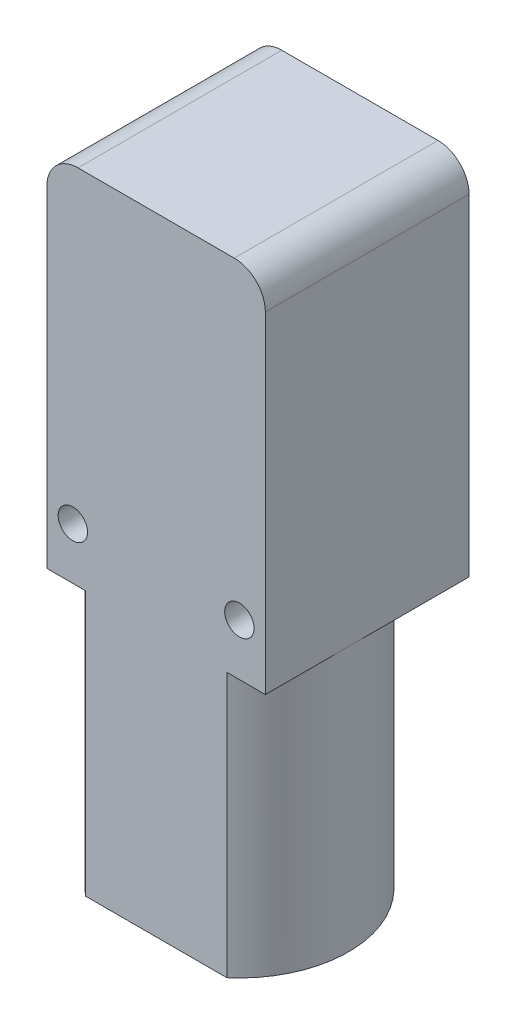
ISO-10303-21;
HEADER;
FILE_DESCRIPTION(('STEP AP214'),'2;1');
FILE_NAME('part.step','',(''),(''),'','','');
FILE_SCHEMA(('AUTOMOTIVE_DESIGN { 1 0 10303 214 1 1 1 1 }'));
ENDSEC;
DATA;
#1=APPLICATION_CONTEXT('core data for automotive mechanical design processes');
#2=APPLICATION_PROTOCOL_DEFINITION('international standard','automotive_design',2000,#1);
#3=PRODUCT_CONTEXT('',#1,'mechanical');
#4=PRODUCT('Part','Part','',(#3));
#5=PRODUCT_RELATED_PRODUCT_CATEGORY('part','',(#4));
#6=PRODUCT_DEFINITION_FORMATION('','',#4);
#7=PRODUCT_DEFINITION_CONTEXT('part definition',#1,'design');
#8=PRODUCT_DEFINITION('design','',#6,#7);
#9=PRODUCT_DEFINITION_SHAPE('','',#8);
#10=(LENGTH_UNIT() NAMED_UNIT(*) SI_UNIT(.MILLI.,.METRE.));
#11=(NAMED_UNIT(*) PLANE_ANGLE_UNIT() SI_UNIT($,.RADIAN.));
#12=(NAMED_UNIT(*) SI_UNIT($,.STERADIAN.) SOLID_ANGLE_UNIT());
#13=UNCERTAINTY_MEASURE_WITH_UNIT(LENGTH_MEASURE(1.E-05),#10,'distance_accuracy_value','');
#14=(GEOMETRIC_REPRESENTATION_CONTEXT(3) GLOBAL_UNCERTAINTY_ASSIGNED_CONTEXT((#13)) GLOBAL_UNIT_ASSIGNED_CONTEXT((#10,
#11,#12)) REPRESENTATION_CONTEXT('',''));
#15=CARTESIAN_POINT('',(0.,0.,0.));
#16=DIRECTION('',(0.,0.,1.));
#17=DIRECTION('',(1.,0.,0.));
#18=AXIS2_PLACEMENT_3D('',#15,#16,#17);
#19=CARTESIAN_POINT('',(0.,0.,5.));
#20=DIRECTION('',(0.,0.,1.));
#21=DIRECTION('',(1.,0.,0.));
#22=AXIS2_PLACEMENT_3D('',#19,#20,#21);
#23=PLANE('',#22);
#24=CARTESIAN_POINT('',(0.,0.,5.));
#25=DIRECTION('',(0.,0.,-1.));
#26=DIRECTION('',(-1.,0.,0.));
#27=AXIS2_PLACEMENT_3D('',#24,#25,#26);
#28=CIRCLE('',#27,3.5);
#29=CARTESIAN_POINT('',(-2.5475478405714,-2.4,5.));
#30=VERTEX_POINT('',#29);
#31=CARTESIAN_POINT('',(-2.5475478405714,2.4,5.));
#32=VERTEX_POINT('',#31);
#33=EDGE_CURVE('E201',#30,#32,#28,.T.);
#34=ORIENTED_EDGE('',*,*,#33,.F.);
#35=DIRECTION('',(-1.,0.,0.));
#36=VECTOR('',#35,1.);
#37=CARTESIAN_POINT('',(-2.5475478405714,-2.4,5.));
#38=LINE('',#37,#36);
#39=CARTESIAN_POINT('',(2.5475478405714,-2.4,5.));
#40=VERTEX_POINT('',#39);
#41=EDGE_CURVE('E194',#40,#30,#38,.T.);
#42=ORIENTED_EDGE('',*,*,#41,.F.);
#43=CARTESIAN_POINT('',(0.,0.,5.));
#44=DIRECTION('',(0.,0.,-1.));
#45=DIRECTION('',(-1.,0.,0.));
#46=AXIS2_PLACEMENT_3D('',#43,#44,#45);
#47=CIRCLE('',#46,3.5);
#48=CARTESIAN_POINT('',(2.5475478405714,2.4,5.));
#49=VERTEX_POINT('',#48);
#50=EDGE_CURVE('E207',#49,#40,#47,.T.);
#51=ORIENTED_EDGE('',*,*,#50,.F.);
#52=DIRECTION('',(1.,0.,0.));
#53=VECTOR('',#52,1.);
#54=CARTESIAN_POINT('',(-2.5475478405714,2.4,5.));
#55=LINE('',#54,#53);
#56=EDGE_CURVE('E204',#32,#49,#55,.T.);
#57=ORIENTED_EDGE('',*,*,#56,.F.);
#58=EDGE_LOOP('',(#34,#42,#51,#57));
#59=FACE_BOUND('',#58,.T.);
#60=CARTESIAN_POINT('',(8.5,-20.23,5.));
#61=DIRECTION('',(0.,0.,-1.));
#62=DIRECTION('',(-1.,0.,0.));
#63=AXIS2_PLACEMENT_3D('',#60,#61,#62);
#64=CIRCLE('',#63,1.5);
#65=CARTESIAN_POINT('',(7.,-20.23,5.));
#66=VERTEX_POINT('',#65);
#67=EDGE_CURVE('E224',#66,#66,#64,.T.);
#68=ORIENTED_EDGE('',*,*,#67,.F.);
#69=EDGE_LOOP('',(#68));
#70=FACE_BOUND('',#69,.T.);
#71=CARTESIAN_POINT('',(-8.5,-20.23,5.));
#72=DIRECTION('',(0.,0.,-1.));
#73=DIRECTION('',(-1.,0.,0.));
#74=AXIS2_PLACEMENT_3D('',#71,#72,#73);
#75=CIRCLE('',#74,1.5);
#76=CARTESIAN_POINT('',(-10.,-20.23,5.));
#77=VERTEX_POINT('',#76);
#78=EDGE_CURVE('E230',#77,#77,#75,.T.);
#79=ORIENTED_EDGE('',*,*,#78,.F.);
#80=EDGE_LOOP('',(#79));
#81=FACE_BOUND('',#80,.T.);
#82=DIRECTION('',(1.,0.,0.));
#83=VECTOR('',#82,1.);
#84=CARTESIAN_POINT('',(0.,-25.5,5.));
#85=LINE('',#84,#83);
#86=CARTESIAN_POINT('',(-11.15,-25.5,5.));
#87=VERTEX_POINT('',#86);
#88=CARTESIAN_POINT('',(11.15,-25.5,5.));
#89=VERTEX_POINT('',#88);
#90=EDGE_CURVE('E185',#87,#89,#85,.T.);
#91=ORIENTED_EDGE('',*,*,#90,.F.);
#92=DIRECTION('',(0.,-1.,0.));
#93=VECTOR('',#92,1.);
#94=CARTESIAN_POINT('',(-11.15,11.5,5.));
#95=LINE('',#94,#93);
#96=CARTESIAN_POINT('',(-11.15,8.325,5.));
#97=VERTEX_POINT('',#96);
#98=EDGE_CURVE('E233',#97,#87,#95,.T.);
#99=ORIENTED_EDGE('',*,*,#98,.F.);
#100=CARTESIAN_POINT('',(-7.975,8.325,5.));
#101=DIRECTION('',(0.,0.,1.));
#102=DIRECTION('',(1.,0.,0.));
#103=AXIS2_PLACEMENT_3D('',#100,#101,#102);
#104=CIRCLE('',#103,3.175);
#105=CARTESIAN_POINT('',(-7.975,11.5,5.));
#106=VERTEX_POINT('',#105);
#107=EDGE_CURVE('E257',#97,#106,#104,.F.);
#108=ORIENTED_EDGE('',*,*,#107,.T.);
#109=DIRECTION('',(-1.,0.,0.));
#110=VECTOR('',#109,1.);
#111=CARTESIAN_POINT('',(-11.15,11.5,5.));
#112=LINE('',#111,#110);
#113=CARTESIAN_POINT('',(7.97499999999999,11.5,5.));
#114=VERTEX_POINT('',#113);
#115=EDGE_CURVE('E239',#114,#106,#112,.T.);
#116=ORIENTED_EDGE('',*,*,#115,.F.);
#117=CARTESIAN_POINT('',(7.97499999999999,8.325,5.));
#118=DIRECTION('',(0.,0.,1.));
#119=DIRECTION('',(1.,0.,0.));
#120=AXIS2_PLACEMENT_3D('',#117,#118,#119);
#121=CIRCLE('',#120,3.175);
#122=CARTESIAN_POINT('',(11.15,8.325,5.));
#123=VERTEX_POINT('',#122);
#124=EDGE_CURVE('E259',#114,#123,#121,.F.);
#125=ORIENTED_EDGE('',*,*,#124,.T.);
#126=DIRECTION('',(0.,1.,0.));
#127=VECTOR('',#126,1.);
#128=CARTESIAN_POINT('',(11.15,11.5,5.));
#129=LINE('',#128,#127);
#130=EDGE_CURVE('E249',#89,#123,#129,.T.);
#131=ORIENTED_EDGE('',*,*,#130,.F.);
#132=EDGE_LOOP('',(#91,#99,#108,#116,#125,#131));
#133=FACE_BOUND('',#132,.T.);
#134=ADVANCED_FACE('F34',(#59,#70,#81,#133),#23,.F.);
#135=CARTESIAN_POINT('',(-11.15,11.5,25.8));
#136=DIRECTION('',(1.,0.,0.));
#137=DIRECTION('',(0.,1.,0.));
#138=AXIS2_PLACEMENT_3D('',#135,#136,#137);
#139=PLANE('',#138);
#140=DIRECTION('',(0.,0.,-1.));
#141=VECTOR('',#140,1.);
#142=CARTESIAN_POINT('',(-11.15,-25.5,25.8));
#143=LINE('',#142,#141);
#144=CARTESIAN_POINT('',(-11.15,-25.5,25.8));
#145=VERTEX_POINT('',#144);
#146=CARTESIAN_POINT('',(-11.15,-25.5,17.3));
#147=VERTEX_POINT('',#146);
#148=EDGE_CURVE('E189',#145,#147,#143,.T.);
#149=ORIENTED_EDGE('',*,*,#148,.F.);
#150=DIRECTION('',(0.,-1.,0.));
#151=VECTOR('',#150,1.);
#152=CARTESIAN_POINT('',(-11.15,11.5,25.8));
#153=LINE('',#152,#151);
#154=CARTESIAN_POINT('',(-11.15,8.325,25.8));
#155=VERTEX_POINT('',#154);
#156=EDGE_CURVE('E236',#155,#145,#153,.T.);
#157=ORIENTED_EDGE('',*,*,#156,.F.);
#158=DIRECTION('',(0.,0.,-1.));
#159=VECTOR('',#158,1.);
#160=CARTESIAN_POINT('',(-11.15,8.325,25.8));
#161=LINE('',#160,#159);
#162=EDGE_CURVE('E267',#155,#97,#161,.T.);
#163=ORIENTED_EDGE('',*,*,#162,.T.);
#164=ORIENTED_EDGE('',*,*,#98,.T.);
#165=EDGE_CURVE('E187',#147,#87,#143,.T.);
#166=ORIENTED_EDGE('',*,*,#165,.F.);
#167=EDGE_LOOP('',(#149,#157,#163,#164,#166));
#168=FACE_BOUND('',#167,.T.);
#169=ADVANCED_FACE('F297',(#168),#139,.F.);
#170=CARTESIAN_POINT('',(-11.15,-52.5,25.8));
#171=DIRECTION('',(0.,1.,0.));
#172=DIRECTION('',(0.,0.,1.));
#173=AXIS2_PLACEMENT_3D('',#170,#171,#172);
#174=PLANE('',#173);
#175=CARTESIAN_POINT('',(0.,-52.5,17.3));
#176=DIRECTION('',(0.,-1.,0.));
#177=DIRECTION('',(0.,0.,-1.));
#178=AXIS2_PLACEMENT_3D('',#175,#176,#177);
#179=CIRCLE('',#178,11.15);
#180=CARTESIAN_POINT('',(-7.21612777048745,-52.5,25.8));
#181=VERTEX_POINT('',#180);
#182=CARTESIAN_POINT('',(-7.21612777048744,-52.5,8.8));
#183=VERTEX_POINT('',#182);
#184=EDGE_CURVE('E172',#181,#183,#179,.T.);
#185=ORIENTED_EDGE('',*,*,#184,.T.);
#186=DIRECTION('',(1.,0.,0.));
#187=VECTOR('',#186,1.);
#188=CARTESIAN_POINT('',(-7.21612777048744,-52.5,8.8));
#189=LINE('',#188,#187);
#190=CARTESIAN_POINT('',(7.21612777048744,-52.5,8.79999999999999));
#191=VERTEX_POINT('',#190);
#192=EDGE_CURVE('E163',#183,#191,#189,.T.);
#193=ORIENTED_EDGE('',*,*,#192,.T.);
#194=CARTESIAN_POINT('',(0.,-52.5,17.3));
#195=DIRECTION('',(0.,-1.,0.));
#196=DIRECTION('',(0.,0.,-1.));
#197=AXIS2_PLACEMENT_3D('',#194,#195,#196);
#198=CIRCLE('',#197,11.15);
#199=CARTESIAN_POINT('',(7.21612777048745,-52.5,25.8));
#200=VERTEX_POINT('',#199);
#201=EDGE_CURVE('E156',#191,#200,#198,.T.);
#202=ORIENTED_EDGE('',*,*,#201,.T.);
#203=DIRECTION('',(1.,0.,0.));
#204=VECTOR('',#203,1.);
#205=CARTESIAN_POINT('',(-11.15,-52.5,25.8));
#206=LINE('',#205,#204);
#207=EDGE_CURVE('E238',#181,#200,#206,.T.);
#208=ORIENTED_EDGE('',*,*,#207,.F.);
#209=EDGE_LOOP('',(#185,#193,#202,#208));
#210=FACE_BOUND('',#209,.T.);
#211=ADVANCED_FACE('F303',(#210),#174,.F.);
#212=CARTESIAN_POINT('',(11.15,11.5,25.8));
#213=DIRECTION('',(-1.,0.,0.));
#214=DIRECTION('',(0.,-1.,0.));
#215=AXIS2_PLACEMENT_3D('',#212,#213,#214);
#216=PLANE('',#215);
#217=DIRECTION('',(0.,0.,1.));
#218=VECTOR('',#217,1.);
#219=CARTESIAN_POINT('',(11.15,-25.5,25.8));
#220=LINE('',#219,#218);
#221=CARTESIAN_POINT('',(11.15,-25.5,17.3));
#222=VERTEX_POINT('',#221);
#223=EDGE_CURVE('E184',#89,#222,#220,.T.);
#224=ORIENTED_EDGE('',*,*,#223,.F.);
#225=ORIENTED_EDGE('',*,*,#130,.T.);
#226=DIRECTION('',(0.,0.,-1.));
#227=VECTOR('',#226,1.);
#228=CARTESIAN_POINT('',(11.15,8.325,25.8));
#229=LINE('',#228,#227);
#230=CARTESIAN_POINT('',(11.15,8.325,25.8));
#231=VERTEX_POINT('',#230);
#232=EDGE_CURVE('E262',#123,#231,#229,.F.);
#233=ORIENTED_EDGE('',*,*,#232,.T.);
#234=DIRECTION('',(0.,1.,0.));
#235=VECTOR('',#234,1.);
#236=CARTESIAN_POINT('',(11.15,11.5,25.8));
#237=LINE('',#236,#235);
#238=CARTESIAN_POINT('',(11.15,-25.5,25.8));
#239=VERTEX_POINT('',#238);
#240=EDGE_CURVE('E242',#239,#231,#237,.T.);
#241=ORIENTED_EDGE('',*,*,#240,.F.);
#242=EDGE_CURVE('E179',#222,#239,#220,.T.);
#243=ORIENTED_EDGE('',*,*,#242,.F.);
#244=EDGE_LOOP('',(#224,#225,#233,#241,#243));
#245=FACE_BOUND('',#244,.T.);
#246=ADVANCED_FACE('F281',(#245),#216,.F.);
#247=CARTESIAN_POINT('',(0.,0.,25.8));
#248=DIRECTION('',(0.,0.,1.));
#249=DIRECTION('',(1.,0.,0.));
#250=AXIS2_PLACEMENT_3D('',#247,#248,#249);
#251=PLANE('',#250);
#252=DIRECTION('',(0.,-1.,0.));
#253=VECTOR('',#252,1.);
#254=CARTESIAN_POINT('',(7.21612777048745,-25.5,25.8));
#255=LINE('',#254,#253);
#256=CARTESIAN_POINT('',(7.21612777048745,-25.5,25.8));
#257=VERTEX_POINT('',#256);
#258=EDGE_CURVE('E180',#257,#200,#255,.T.);
#259=ORIENTED_EDGE('',*,*,#258,.F.);
#260=DIRECTION('',(1.,0.,0.));
#261=VECTOR('',#260,1.);
#262=CARTESIAN_POINT('',(0.,-25.5,25.8));
#263=LINE('',#262,#261);
#264=EDGE_CURVE('E38',#257,#239,#263,.T.);
#265=ORIENTED_EDGE('',*,*,#264,.T.);
#266=ORIENTED_EDGE('',*,*,#240,.T.);
#267=CARTESIAN_POINT('',(7.97499999999999,8.325,25.8));
#268=DIRECTION('',(0.,0.,1.));
#269=DIRECTION('',(1.,0.,0.));
#270=AXIS2_PLACEMENT_3D('',#267,#268,#269);
#271=CIRCLE('',#270,3.175);
#272=CARTESIAN_POINT('',(7.97499999999999,11.5,25.8));
#273=VERTEX_POINT('',#272);
#274=EDGE_CURVE('E266',#231,#273,#271,.T.);
#275=ORIENTED_EDGE('',*,*,#274,.T.);
#276=DIRECTION('',(-1.,0.,0.));
#277=VECTOR('',#276,1.);
#278=CARTESIAN_POINT('',(-11.15,11.5,25.8));
#279=LINE('',#278,#277);
#280=CARTESIAN_POINT('',(-7.975,11.5,25.8));
#281=VERTEX_POINT('',#280);
#282=EDGE_CURVE('E244',#273,#281,#279,.T.);
#283=ORIENTED_EDGE('',*,*,#282,.T.);
#284=CARTESIAN_POINT('',(-7.975,8.325,25.8));
#285=DIRECTION('',(0.,0.,1.));
#286=DIRECTION('',(1.,0.,0.));
#287=AXIS2_PLACEMENT_3D('',#284,#285,#286);
#288=CIRCLE('',#287,3.175);
#289=EDGE_CURVE('E57',#281,#155,#288,.T.);
#290=ORIENTED_EDGE('',*,*,#289,.T.);
#291=ORIENTED_EDGE('',*,*,#156,.T.);
#292=CARTESIAN_POINT('',(-7.21612777048745,-25.5,25.8));
#293=VERTEX_POINT('',#292);
#294=EDGE_CURVE('E12',#145,#293,#263,.T.);
#295=ORIENTED_EDGE('',*,*,#294,.T.);
#296=DIRECTION('',(0.,-1.,0.));
#297=VECTOR('',#296,1.);
#298=CARTESIAN_POINT('',(-7.21612777048745,-25.5,25.8));
#299=LINE('',#298,#297);
#300=EDGE_CURVE('E176',#293,#181,#299,.T.);
#301=ORIENTED_EDGE('',*,*,#300,.T.);
#302=ORIENTED_EDGE('',*,*,#207,.T.);
#303=EDGE_LOOP('',(#259,#265,#266,#275,#283,#290,#291,#295,#301,#302));
#304=FACE_BOUND('',#303,.T.);
#305=CARTESIAN_POINT('',(8.5,-20.23,25.8));
#306=DIRECTION('',(0.,0.,1.));
#307=DIRECTION('',(1.,0.,0.));
#308=AXIS2_PLACEMENT_3D('',#305,#306,#307);
#309=CIRCLE('',#308,1.5);
#310=CARTESIAN_POINT('',(7.,-20.23,25.8));
#311=VERTEX_POINT('',#310);
#312=EDGE_CURVE('E223',#311,#311,#309,.F.);
#313=ORIENTED_EDGE('',*,*,#312,.T.);
#314=EDGE_LOOP('',(#313));
#315=FACE_BOUND('',#314,.T.);
#316=CARTESIAN_POINT('',(-8.5,-20.23,25.8));
#317=DIRECTION('',(0.,0.,1.));
#318=DIRECTION('',(1.,0.,0.));
#319=AXIS2_PLACEMENT_3D('',#316,#317,#318);
#320=CIRCLE('',#319,1.5);
#321=CARTESIAN_POINT('',(-10.,-20.23,25.8));
#322=VERTEX_POINT('',#321);
#323=EDGE_CURVE('E227',#322,#322,#320,.F.);
#324=ORIENTED_EDGE('',*,*,#323,.T.);
#325=EDGE_LOOP('',(#324));
#326=FACE_BOUND('',#325,.T.);
#327=ADVANCED_FACE('F275',(#304,#315,#326),#251,.T.);
#328=CARTESIAN_POINT('',(-11.15,11.5,25.8));
#329=DIRECTION('',(0.,-1.,0.));
#330=DIRECTION('',(0.,0.,-1.));
#331=AXIS2_PLACEMENT_3D('',#328,#329,#330);
#332=PLANE('',#331);
#333=ORIENTED_EDGE('',*,*,#282,.F.);
#334=DIRECTION('',(0.,0.,-1.));
#335=VECTOR('',#334,1.);
#336=CARTESIAN_POINT('',(7.97499999999999,11.5,25.8));
#337=LINE('',#336,#335);
#338=EDGE_CURVE('E254',#273,#114,#337,.T.);
#339=ORIENTED_EDGE('',*,*,#338,.T.);
#340=ORIENTED_EDGE('',*,*,#115,.T.);
#341=DIRECTION('',(0.,0.,-1.));
#342=VECTOR('',#341,1.);
#343=CARTESIAN_POINT('',(-7.975,11.5,25.8));
#344=LINE('',#343,#342);
#345=EDGE_CURVE('E246',#106,#281,#344,.F.);
#346=ORIENTED_EDGE('',*,*,#345,.T.);
#347=EDGE_LOOP('',(#333,#339,#340,#346));
#348=FACE_BOUND('',#347,.T.);
#349=ADVANCED_FACE('F290',(#348),#332,.F.);
#350=CARTESIAN_POINT('',(-8.5,-20.23,25.801));
#351=DIRECTION('',(0.,0.,-1.));
#352=DIRECTION('',(-1.,0.,0.));
#353=AXIS2_PLACEMENT_3D('',#350,#351,#352);
#354=CYLINDRICAL_SURFACE('',#353,1.5);
#355=CARTESIAN_POINT('',(-10.,-20.23,25.8));
#356=CARTESIAN_POINT('',(-10.,-20.23,25.5833333333333));
#357=CARTESIAN_POINT('',(-10.,-20.23,25.3666666666667));
#358=CARTESIAN_POINT('',(-10.,-20.23,24.9333333333333));
#359=CARTESIAN_POINT('',(-10.,-20.23,24.7166666666667));
#360=CARTESIAN_POINT('',(-10.,-20.23,24.2833333333333));
#361=CARTESIAN_POINT('',(-10.,-20.23,24.0666666666667));
#362=CARTESIAN_POINT('',(-10.,-20.23,23.6333333333333));
#363=CARTESIAN_POINT('',(-10.,-20.23,23.4166666666667));
#364=CARTESIAN_POINT('',(-10.,-20.23,22.9833333333333));
#365=CARTESIAN_POINT('',(-10.,-20.23,22.7666666666667));
#366=CARTESIAN_POINT('',(-10.,-20.23,22.3333333333333));
#367=CARTESIAN_POINT('',(-10.,-20.23,22.1166666666667));
#368=CARTESIAN_POINT('',(-10.,-20.23,21.6833333333333));
#369=CARTESIAN_POINT('',(-10.,-20.23,21.4666666666667));
#370=CARTESIAN_POINT('',(-10.,-20.23,21.0333333333333));
#371=CARTESIAN_POINT('',(-10.,-20.23,20.8166666666667));
#372=CARTESIAN_POINT('',(-10.,-20.23,20.3833333333333));
#373=CARTESIAN_POINT('',(-10.,-20.23,20.1666666666667));
#374=CARTESIAN_POINT('',(-10.,-20.23,19.7333333333333));
#375=CARTESIAN_POINT('',(-10.,-20.23,19.5166666666667));
#376=CARTESIAN_POINT('',(-10.,-20.23,19.0833333333333));
#377=CARTESIAN_POINT('',(-10.,-20.23,18.8666666666667));
#378=CARTESIAN_POINT('',(-10.,-20.23,18.4333333333333));
#379=CARTESIAN_POINT('',(-10.,-20.23,18.2166666666667));
#380=CARTESIAN_POINT('',(-10.,-20.23,17.7833333333333));
#381=CARTESIAN_POINT('',(-10.,-20.23,17.5666666666667));
#382=CARTESIAN_POINT('',(-10.,-20.23,17.1333333333333));
#383=CARTESIAN_POINT('',(-10.,-20.23,16.9166666666667));
#384=CARTESIAN_POINT('',(-10.,-20.23,16.4833333333333));
#385=CARTESIAN_POINT('',(-10.,-20.23,16.2666666666667));
#386=CARTESIAN_POINT('',(-10.,-20.23,15.8333333333333));
#387=CARTESIAN_POINT('',(-10.,-20.23,15.6166666666667));
#388=CARTESIAN_POINT('',(-10.,-20.23,15.1833333333333));
#389=CARTESIAN_POINT('',(-10.,-20.23,14.9666666666667));
#390=CARTESIAN_POINT('',(-10.,-20.23,14.5333333333333));
#391=CARTESIAN_POINT('',(-10.,-20.23,14.3166666666667));
#392=CARTESIAN_POINT('',(-10.,-20.23,13.8833333333333));
#393=CARTESIAN_POINT('',(-10.,-20.23,13.6666666666667));
#394=CARTESIAN_POINT('',(-10.,-20.23,13.2333333333333));
#395=CARTESIAN_POINT('',(-10.,-20.23,13.0166666666667));
#396=CARTESIAN_POINT('',(-10.,-20.23,12.5833333333333));
#397=CARTESIAN_POINT('',(-10.,-20.23,12.3666666666667));
#398=CARTESIAN_POINT('',(-10.,-20.23,11.9333333333333));
#399=CARTESIAN_POINT('',(-10.,-20.23,11.7166666666667));
#400=CARTESIAN_POINT('',(-10.,-20.23,11.2833333333333));
#401=CARTESIAN_POINT('',(-10.,-20.23,11.0666666666667));
#402=CARTESIAN_POINT('',(-10.,-20.23,10.6333333333333));
#403=CARTESIAN_POINT('',(-10.,-20.23,10.4166666666667));
#404=CARTESIAN_POINT('',(-10.,-20.23,9.98333333333333));
#405=CARTESIAN_POINT('',(-10.,-20.23,9.76666666666666));
#406=CARTESIAN_POINT('',(-10.,-20.23,9.33333333333333));
#407=CARTESIAN_POINT('',(-10.,-20.23,9.11666666666666));
#408=CARTESIAN_POINT('',(-10.,-20.23,8.68333333333333));
#409=CARTESIAN_POINT('',(-10.,-20.23,8.46666666666666));
#410=CARTESIAN_POINT('',(-10.,-20.23,8.03333333333333));
#411=CARTESIAN_POINT('',(-10.,-20.23,7.81666666666666));
#412=CARTESIAN_POINT('',(-10.,-20.23,7.38333333333333));
#413=CARTESIAN_POINT('',(-10.,-20.23,7.16666666666666));
#414=CARTESIAN_POINT('',(-10.,-20.23,6.73333333333333));
#415=CARTESIAN_POINT('',(-10.,-20.23,6.51666666666666));
#416=CARTESIAN_POINT('',(-10.,-20.23,6.08333333333333));
#417=CARTESIAN_POINT('',(-10.,-20.23,5.86666666666666));
#418=CARTESIAN_POINT('',(-10.,-20.23,5.43333333333333));
#419=CARTESIAN_POINT('',(-10.,-20.23,5.21666666666666));
#420=CARTESIAN_POINT('',(-10.,-20.23,5.));
#421=B_SPLINE_CURVE_WITH_KNOTS('',3,(#355,#356,#357,#358,#359,#360,#361,#362,#363,#364,#365,
#366,#367,#368,#369,#370,#371,#372,#373,#374,#375,#376,#377,#378,#379,#380,#381,#382,#383,#384,
#385,#386,#387,#388,#389,#390,#391,#392,#393,#394,#395,#396,#397,#398,#399,#400,#401,#402,#403,
#404,#405,#406,#407,#408,#409,#410,#411,#412,#413,#414,#415,#416,#417,#418,#419,#420),
.UNSPECIFIED.,.F.,.F.,(4,2,2,2,2,2,2,2,2,2,2,2,2,2,2,2,2,2,2,2,2,2,2,2,2,2,2,2,2,2,2,2,4),(0.,
0.650000000000001,1.3,1.95,2.6,3.25,3.9,4.55,5.2,5.85,6.5,7.15,7.80000000000001,8.45,9.1,
9.75000000000001,10.4,11.05,11.7,12.35,13.,13.65,14.3,14.95,15.6,16.25,16.9,17.55,18.2,18.85,
19.5,20.15,20.8),.UNSPECIFIED.);
#422=EDGE_CURVE('BSEAM331',#322,#77,#421,.T.);
#423=ORIENTED_EDGE('',*,*,#323,.F.);
#424=ORIENTED_EDGE('',*,*,#78,.T.);
#425=ORIENTED_EDGE('',*,*,#422,.T.);
#426=ORIENTED_EDGE('',*,*,#422,.F.);
#427=EDGE_LOOP('',(#423,#425,#424,#426));
#428=FACE_BOUND('',#427,.T.);
#429=ADVANCED_FACE('F331',(#428),#354,.F.);
#430=CARTESIAN_POINT('',(8.5,-20.23,25.801));
#431=DIRECTION('',(0.,0.,-1.));
#432=DIRECTION('',(-1.,0.,0.));
#433=AXIS2_PLACEMENT_3D('',#430,#431,#432);
#434=CYLINDRICAL_SURFACE('',#433,1.5);
#435=CARTESIAN_POINT('',(7.,-20.23,25.8));
#436=CARTESIAN_POINT('',(7.,-20.23,25.5833333333333));
#437=CARTESIAN_POINT('',(7.,-20.23,25.3666666666667));
#438=CARTESIAN_POINT('',(7.,-20.23,24.9333333333333));
#439=CARTESIAN_POINT('',(7.,-20.23,24.7166666666667));
#440=CARTESIAN_POINT('',(7.,-20.23,24.2833333333333));
#441=CARTESIAN_POINT('',(7.,-20.23,24.0666666666667));
#442=CARTESIAN_POINT('',(7.,-20.23,23.6333333333333));
#443=CARTESIAN_POINT('',(7.,-20.23,23.4166666666667));
#444=CARTESIAN_POINT('',(7.,-20.23,22.9833333333333));
#445=CARTESIAN_POINT('',(7.,-20.23,22.7666666666667));
#446=CARTESIAN_POINT('',(7.,-20.23,22.3333333333333));
#447=CARTESIAN_POINT('',(7.,-20.23,22.1166666666667));
#448=CARTESIAN_POINT('',(7.,-20.23,21.6833333333333));
#449=CARTESIAN_POINT('',(7.,-20.23,21.4666666666667));
#450=CARTESIAN_POINT('',(7.,-20.23,21.0333333333333));
#451=CARTESIAN_POINT('',(7.,-20.23,20.8166666666667));
#452=CARTESIAN_POINT('',(7.,-20.23,20.3833333333333));
#453=CARTESIAN_POINT('',(7.,-20.23,20.1666666666667));
#454=CARTESIAN_POINT('',(7.,-20.23,19.7333333333333));
#455=CARTESIAN_POINT('',(7.,-20.23,19.5166666666667));
#456=CARTESIAN_POINT('',(7.,-20.23,19.0833333333333));
#457=CARTESIAN_POINT('',(7.,-20.23,18.8666666666667));
#458=CARTESIAN_POINT('',(7.,-20.23,18.4333333333333));
#459=CARTESIAN_POINT('',(7.,-20.23,18.2166666666667));
#460=CARTESIAN_POINT('',(7.,-20.23,17.7833333333333));
#461=CARTESIAN_POINT('',(7.,-20.23,17.5666666666667));
#462=CARTESIAN_POINT('',(7.,-20.23,17.1333333333333));
#463=CARTESIAN_POINT('',(7.,-20.23,16.9166666666667));
#464=CARTESIAN_POINT('',(7.,-20.23,16.4833333333333));
#465=CARTESIAN_POINT('',(7.,-20.23,16.2666666666667));
#466=CARTESIAN_POINT('',(7.,-20.23,15.8333333333333));
#467=CARTESIAN_POINT('',(7.,-20.23,15.6166666666667));
#468=CARTESIAN_POINT('',(7.,-20.23,15.1833333333333));
#469=CARTESIAN_POINT('',(7.,-20.23,14.9666666666667));
#470=CARTESIAN_POINT('',(7.,-20.23,14.5333333333333));
#471=CARTESIAN_POINT('',(7.,-20.23,14.3166666666667));
#472=CARTESIAN_POINT('',(7.,-20.23,13.8833333333333));
#473=CARTESIAN_POINT('',(7.,-20.23,13.6666666666667));
#474=CARTESIAN_POINT('',(7.,-20.23,13.2333333333333));
#475=CARTESIAN_POINT('',(7.,-20.23,13.0166666666667));
#476=CARTESIAN_POINT('',(7.,-20.23,12.5833333333333));
#477=CARTESIAN_POINT('',(7.,-20.23,12.3666666666667));
#478=CARTESIAN_POINT('',(7.,-20.23,11.9333333333333));
#479=CARTESIAN_POINT('',(7.,-20.23,11.7166666666667));
#480=CARTESIAN_POINT('',(7.,-20.23,11.2833333333333));
#481=CARTESIAN_POINT('',(7.,-20.23,11.0666666666667));
#482=CARTESIAN_POINT('',(7.,-20.23,10.6333333333333));
#483=CARTESIAN_POINT('',(7.,-20.23,10.4166666666667));
#484=CARTESIAN_POINT('',(7.,-20.23,9.98333333333333));
#485=CARTESIAN_POINT('',(7.,-20.23,9.76666666666666));
#486=CARTESIAN_POINT('',(7.,-20.23,9.33333333333333));
#487=CARTESIAN_POINT('',(7.,-20.23,9.11666666666666));
#488=CARTESIAN_POINT('',(7.,-20.23,8.68333333333333));
#489=CARTESIAN_POINT('',(7.,-20.23,8.46666666666666));
#490=CARTESIAN_POINT('',(7.,-20.23,8.03333333333333));
#491=CARTESIAN_POINT('',(7.,-20.23,7.81666666666666));
#492=CARTESIAN_POINT('',(7.,-20.23,7.38333333333333));
#493=CARTESIAN_POINT('',(7.,-20.23,7.16666666666666));
#494=CARTESIAN_POINT('',(7.,-20.23,6.73333333333333));
#495=CARTESIAN_POINT('',(7.,-20.23,6.51666666666666));
#496=CARTESIAN_POINT('',(7.,-20.23,6.08333333333333));
#497=CARTESIAN_POINT('',(7.,-20.23,5.86666666666666));
#498=CARTESIAN_POINT('',(7.,-20.23,5.43333333333333));
#499=CARTESIAN_POINT('',(7.,-20.23,5.21666666666666));
#500=CARTESIAN_POINT('',(7.,-20.23,5.));
#501=B_SPLINE_CURVE_WITH_KNOTS('',3,(#435,#436,#437,#438,#439,#440,#441,#442,#443,#444,#445,
#446,#447,#448,#449,#450,#451,#452,#453,#454,#455,#456,#457,#458,#459,#460,#461,#462,#463,#464,
#465,#466,#467,#468,#469,#470,#471,#472,#473,#474,#475,#476,#477,#478,#479,#480,#481,#482,#483,
#484,#485,#486,#487,#488,#489,#490,#491,#492,#493,#494,#495,#496,#497,#498,#499,#500),
.UNSPECIFIED.,.F.,.F.,(4,2,2,2,2,2,2,2,2,2,2,2,2,2,2,2,2,2,2,2,2,2,2,2,2,2,2,2,2,2,2,2,4),(0.,
0.650000000000001,1.3,1.95,2.6,3.25,3.9,4.55,5.2,5.85,6.5,7.15,7.80000000000001,8.45,9.1,
9.75000000000001,10.4,11.05,11.7,12.35,13.,13.65,14.3,14.95,15.6,16.25,16.9,17.55,18.2,18.85,
19.5,20.15,20.8),.UNSPECIFIED.);
#502=EDGE_CURVE('BSEAM360',#311,#66,#501,.T.);
#503=ORIENTED_EDGE('',*,*,#312,.F.);
#504=ORIENTED_EDGE('',*,*,#67,.T.);
#505=ORIENTED_EDGE('',*,*,#502,.T.);
#506=ORIENTED_EDGE('',*,*,#502,.F.);
#507=EDGE_LOOP('',(#503,#505,#504,#506));
#508=FACE_BOUND('',#507,.T.);
#509=ADVANCED_FACE('F360',(#508),#434,.F.);
#510=CARTESIAN_POINT('',(0.,0.,0.));
#511=DIRECTION('',(0.,0.,1.));
#512=DIRECTION('',(1.,0.,0.));
#513=AXIS2_PLACEMENT_3D('',#510,#511,#512);
#514=CYLINDRICAL_SURFACE('',#513,3.5);
#515=ORIENTED_EDGE('',*,*,#33,.T.);
#516=DIRECTION('',(0.,0.,1.));
#517=VECTOR('',#516,1.);
#518=CARTESIAN_POINT('',(-2.5475478405714,2.4,0.));
#519=LINE('',#518,#517);
#520=CARTESIAN_POINT('',(-2.5475478405714,2.4,0.));
#521=VERTEX_POINT('',#520);
#522=EDGE_CURVE('E220',#521,#32,#519,.T.);
#523=ORIENTED_EDGE('',*,*,#522,.F.);
#524=CARTESIAN_POINT('',(0.,0.,0.));
#525=DIRECTION('',(0.,0.,-1.));
#526=DIRECTION('',(-1.,0.,0.));
#527=AXIS2_PLACEMENT_3D('',#524,#525,#526);
#528=CIRCLE('',#527,3.5);
#529=CARTESIAN_POINT('',(-2.5475478405714,-2.4,0.));
#530=VERTEX_POINT('',#529);
#531=EDGE_CURVE('E190',#530,#521,#528,.T.);
#532=ORIENTED_EDGE('',*,*,#531,.F.);
#533=DIRECTION('',(0.,0.,1.));
#534=VECTOR('',#533,1.);
#535=CARTESIAN_POINT('',(-2.5475478405714,-2.4,0.));
#536=LINE('',#535,#534);
#537=EDGE_CURVE('E200',#530,#30,#536,.T.);
#538=ORIENTED_EDGE('',*,*,#537,.T.);
#539=EDGE_LOOP('',(#515,#523,#532,#538));
#540=FACE_BOUND('',#539,.T.);
#541=ADVANCED_FACE('F356',(#540),#514,.T.);
#542=CARTESIAN_POINT('',(-2.5475478405714,2.4,0.));
#543=DIRECTION('',(0.,-1.,0.));
#544=DIRECTION('',(0.,0.,-1.));
#545=AXIS2_PLACEMENT_3D('',#542,#543,#544);
#546=PLANE('',#545);
#547=ORIENTED_EDGE('',*,*,#56,.T.);
#548=DIRECTION('',(0.,0.,1.));
#549=VECTOR('',#548,1.);
#550=CARTESIAN_POINT('',(2.5475478405714,2.4,0.));
#551=LINE('',#550,#549);
#552=CARTESIAN_POINT('',(2.5475478405714,2.4,0.));
#553=VERTEX_POINT('',#552);
#554=EDGE_CURVE('E217',#553,#49,#551,.T.);
#555=ORIENTED_EDGE('',*,*,#554,.F.);
#556=DIRECTION('',(1.,0.,0.));
#557=VECTOR('',#556,1.);
#558=CARTESIAN_POINT('',(-2.5475478405714,2.4,0.));
#559=LINE('',#558,#557);
#560=EDGE_CURVE('E193',#521,#553,#559,.T.);
#561=ORIENTED_EDGE('',*,*,#560,.F.);
#562=ORIENTED_EDGE('',*,*,#522,.T.);
#563=EDGE_LOOP('',(#547,#555,#561,#562));
#564=FACE_BOUND('',#563,.T.);
#565=ADVANCED_FACE('F352',(#564),#546,.F.);
#566=CARTESIAN_POINT('',(0.,0.,0.));
#567=DIRECTION('',(0.,0.,1.));
#568=DIRECTION('',(1.,0.,0.));
#569=AXIS2_PLACEMENT_3D('',#566,#567,#568);
#570=CYLINDRICAL_SURFACE('',#569,3.5);
#571=ORIENTED_EDGE('',*,*,#50,.T.);
#572=DIRECTION('',(0.,0.,1.));
#573=VECTOR('',#572,1.);
#574=CARTESIAN_POINT('',(2.5475478405714,-2.4,0.));
#575=LINE('',#574,#573);
#576=CARTESIAN_POINT('',(2.5475478405714,-2.4,0.));
#577=VERTEX_POINT('',#576);
#578=EDGE_CURVE('E214',#577,#40,#575,.T.);
#579=ORIENTED_EDGE('',*,*,#578,.F.);
#580=CARTESIAN_POINT('',(0.,0.,0.));
#581=DIRECTION('',(0.,0.,-1.));
#582=DIRECTION('',(-1.,0.,0.));
#583=AXIS2_PLACEMENT_3D('',#580,#581,#582);
#584=CIRCLE('',#583,3.5);
#585=EDGE_CURVE('E196',#553,#577,#584,.T.);
#586=ORIENTED_EDGE('',*,*,#585,.F.);
#587=ORIENTED_EDGE('',*,*,#554,.T.);
#588=EDGE_LOOP('',(#571,#579,#586,#587));
#589=FACE_BOUND('',#588,.T.);
#590=ADVANCED_FACE('F346',(#589),#570,.T.);
#591=CARTESIAN_POINT('',(-2.5475478405714,-2.4,0.));
#592=DIRECTION('',(0.,1.,0.));
#593=DIRECTION('',(0.,0.,1.));
#594=AXIS2_PLACEMENT_3D('',#591,#592,#593);
#595=PLANE('',#594);
#596=ORIENTED_EDGE('',*,*,#41,.T.);
#597=ORIENTED_EDGE('',*,*,#537,.F.);
#598=DIRECTION('',(-1.,0.,0.));
#599=VECTOR('',#598,1.);
#600=CARTESIAN_POINT('',(-2.5475478405714,-2.4,0.));
#601=LINE('',#600,#599);
#602=EDGE_CURVE('E198',#577,#530,#601,.T.);
#603=ORIENTED_EDGE('',*,*,#602,.F.);
#604=ORIENTED_EDGE('',*,*,#578,.T.);
#605=EDGE_LOOP('',(#596,#597,#603,#604));
#606=FACE_BOUND('',#605,.T.);
#607=ADVANCED_FACE('F341',(#606),#595,.F.);
#608=CARTESIAN_POINT('',(0.,0.,0.));
#609=DIRECTION('',(0.,0.,-1.));
#610=DIRECTION('',(-1.,0.,0.));
#611=AXIS2_PLACEMENT_3D('',#608,#609,#610);
#612=PLANE('',#611);
#613=ORIENTED_EDGE('',*,*,#531,.T.);
#614=ORIENTED_EDGE('',*,*,#560,.T.);
#615=ORIENTED_EDGE('',*,*,#585,.T.);
#616=ORIENTED_EDGE('',*,*,#602,.T.);
#617=EDGE_LOOP('',(#613,#614,#615,#616));
#618=FACE_BOUND('',#617,.T.);
#619=ADVANCED_FACE('F336',(#618),#612,.T.);
#620=CARTESIAN_POINT('',(7.97499999999999,8.325,25.8));
#621=DIRECTION('',(0.,0.,-1.));
#622=DIRECTION('',(-1.,0.,0.));
#623=AXIS2_PLACEMENT_3D('',#620,#621,#622);
#624=CYLINDRICAL_SURFACE('',#623,3.175);
#625=ORIENTED_EDGE('',*,*,#274,.F.);
#626=ORIENTED_EDGE('',*,*,#232,.F.);
#627=ORIENTED_EDGE('',*,*,#124,.F.);
#628=ORIENTED_EDGE('',*,*,#338,.F.);
#629=EDGE_LOOP('',(#625,#626,#627,#628));
#630=FACE_BOUND('',#629,.T.);
#631=ADVANCED_FACE('F287',(#630),#624,.T.);
#632=CARTESIAN_POINT('',(-7.975,8.325,25.8));
#633=DIRECTION('',(0.,0.,-1.));
#634=DIRECTION('',(-1.,0.,0.));
#635=AXIS2_PLACEMENT_3D('',#632,#633,#634);
#636=CYLINDRICAL_SURFACE('',#635,3.175);
#637=ORIENTED_EDGE('',*,*,#289,.F.);
#638=ORIENTED_EDGE('',*,*,#345,.F.);
#639=ORIENTED_EDGE('',*,*,#107,.F.);
#640=ORIENTED_EDGE('',*,*,#162,.F.);
#641=EDGE_LOOP('',(#637,#638,#639,#640));
#642=FACE_BOUND('',#641,.T.);
#643=ADVANCED_FACE('F36',(#642),#636,.T.);
#644=CARTESIAN_POINT('',(0.,-25.5,12.9));
#645=DIRECTION('',(0.,-1.,0.));
#646=DIRECTION('',(0.,0.,-1.));
#647=AXIS2_PLACEMENT_3D('',#644,#645,#646);
#648=PLANE('',#647);
#649=ORIENTED_EDGE('',*,*,#165,.T.);
#650=ORIENTED_EDGE('',*,*,#90,.T.);
#651=ORIENTED_EDGE('',*,*,#223,.T.);
#652=CARTESIAN_POINT('',(0.,-25.5,17.3));
#653=DIRECTION('',(0.,-1.,0.));
#654=DIRECTION('',(0.,0.,-1.));
#655=AXIS2_PLACEMENT_3D('',#652,#653,#654);
#656=CIRCLE('',#655,11.15);
#657=CARTESIAN_POINT('',(7.21612777048744,-25.5,8.8));
#658=VERTEX_POINT('',#657);
#659=EDGE_CURVE('E165',#658,#222,#656,.T.);
#660=ORIENTED_EDGE('',*,*,#659,.F.);
#661=DIRECTION('',(1.,0.,0.));
#662=VECTOR('',#661,1.);
#663=CARTESIAN_POINT('',(-7.21612777048744,-25.5,8.8));
#664=LINE('',#663,#662);
#665=CARTESIAN_POINT('',(-7.21612777048744,-25.5,8.8));
#666=VERTEX_POINT('',#665);
#667=EDGE_CURVE('E161',#666,#658,#664,.T.);
#668=ORIENTED_EDGE('',*,*,#667,.F.);
#669=CARTESIAN_POINT('',(0.,-25.5,17.3));
#670=DIRECTION('',(0.,-1.,0.));
#671=DIRECTION('',(0.,0.,-1.));
#672=AXIS2_PLACEMENT_3D('',#669,#670,#671);
#673=CIRCLE('',#672,11.15);
#674=EDGE_CURVE('E146',#147,#666,#673,.T.);
#675=ORIENTED_EDGE('',*,*,#674,.F.);
#676=EDGE_LOOP('',(#649,#650,#651,#660,#668,#675));
#677=FACE_BOUND('',#676,.T.);
#678=ADVANCED_FACE('F167',(#677),#648,.T.);
#679=ORIENTED_EDGE('',*,*,#242,.T.);
#680=ORIENTED_EDGE('',*,*,#264,.F.);
#681=EDGE_CURVE('E49',#222,#257,#656,.T.);
#682=ORIENTED_EDGE('',*,*,#681,.F.);
#683=EDGE_LOOP('',(#679,#680,#682));
#684=FACE_BOUND('',#683,.T.);
#685=ADVANCED_FACE('F298',(#684),#648,.T.);
#686=CARTESIAN_POINT('',(0.,-25.5,17.3));
#687=DIRECTION('',(0.,-1.,0.));
#688=DIRECTION('',(0.,0.,-1.));
#689=AXIS2_PLACEMENT_3D('',#686,#687,#688);
#690=CYLINDRICAL_SURFACE('',#689,11.15);
#691=EDGE_CURVE('E152',#293,#147,#673,.T.);
#692=ORIENTED_EDGE('',*,*,#691,.T.);
#693=ORIENTED_EDGE('',*,*,#674,.T.);
#694=DIRECTION('',(0.,-1.,0.));
#695=VECTOR('',#694,1.);
#696=CARTESIAN_POINT('',(-7.21612777048744,-25.5,8.8));
#697=LINE('',#696,#695);
#698=EDGE_CURVE('E149',#666,#183,#697,.T.);
#699=ORIENTED_EDGE('',*,*,#698,.T.);
#700=ORIENTED_EDGE('',*,*,#184,.F.);
#701=ORIENTED_EDGE('',*,*,#300,.F.);
#702=EDGE_LOOP('',(#692,#693,#699,#700,#701));
#703=FACE_BOUND('',#702,.T.);
#704=ADVANCED_FACE('F148',(#703),#690,.T.);
#705=CARTESIAN_POINT('',(0.,-25.5,17.3));
#706=DIRECTION('',(0.,-1.,0.));
#707=DIRECTION('',(0.,0.,-1.));
#708=AXIS2_PLACEMENT_3D('',#705,#706,#707);
#709=CYLINDRICAL_SURFACE('',#708,11.15);
#710=ORIENTED_EDGE('',*,*,#659,.T.);
#711=ORIENTED_EDGE('',*,*,#681,.T.);
#712=ORIENTED_EDGE('',*,*,#258,.T.);
#713=ORIENTED_EDGE('',*,*,#201,.F.);
#714=DIRECTION('',(0.,-1.,0.));
#715=VECTOR('',#714,1.);
#716=CARTESIAN_POINT('',(7.21612777048744,-25.5,8.79999999999999));
#717=LINE('',#716,#715);
#718=EDGE_CURVE('E164',#658,#191,#717,.T.);
#719=ORIENTED_EDGE('',*,*,#718,.F.);
#720=EDGE_LOOP('',(#710,#711,#712,#713,#719));
#721=FACE_BOUND('',#720,.T.);
#722=ADVANCED_FACE('F299',(#721),#709,.T.);
#723=ORIENTED_EDGE('',*,*,#148,.T.);
#724=ORIENTED_EDGE('',*,*,#691,.F.);
#725=ORIENTED_EDGE('',*,*,#294,.F.);
#726=EDGE_LOOP('',(#723,#724,#725));
#727=FACE_BOUND('',#726,.T.);
#728=ADVANCED_FACE('F305',(#727),#648,.T.);
#729=CARTESIAN_POINT('',(-7.21612777048744,-25.5,8.8));
#730=DIRECTION('',(0.,0.,-1.));
#731=DIRECTION('',(-1.,0.,0.));
#732=AXIS2_PLACEMENT_3D('',#729,#730,#731);
#733=PLANE('',#732);
#734=ORIENTED_EDGE('',*,*,#192,.F.);
#735=ORIENTED_EDGE('',*,*,#698,.F.);
#736=ORIENTED_EDGE('',*,*,#667,.T.);
#737=ORIENTED_EDGE('',*,*,#718,.T.);
#738=EDGE_LOOP('',(#734,#735,#736,#737));
#739=FACE_BOUND('',#738,.T.);
#740=ADVANCED_FACE('F160',(#739),#733,.T.);
#741=CLOSED_SHELL('',(#134,#169,#211,#246,#327,#349,#429,#509,#541,#565,#590,#607,#619,#631,
#643,#678,#685,#704,#722,#728,#740));
#742=MANIFOLD_SOLID_BREP('B2',#741);
#743=ADVANCED_BREP_SHAPE_REPRESENTATION('',(#18,#742),#14);
#744=SHAPE_DEFINITION_REPRESENTATION(#9,#743);
ENDSEC;
END-ISO-10303-21;
